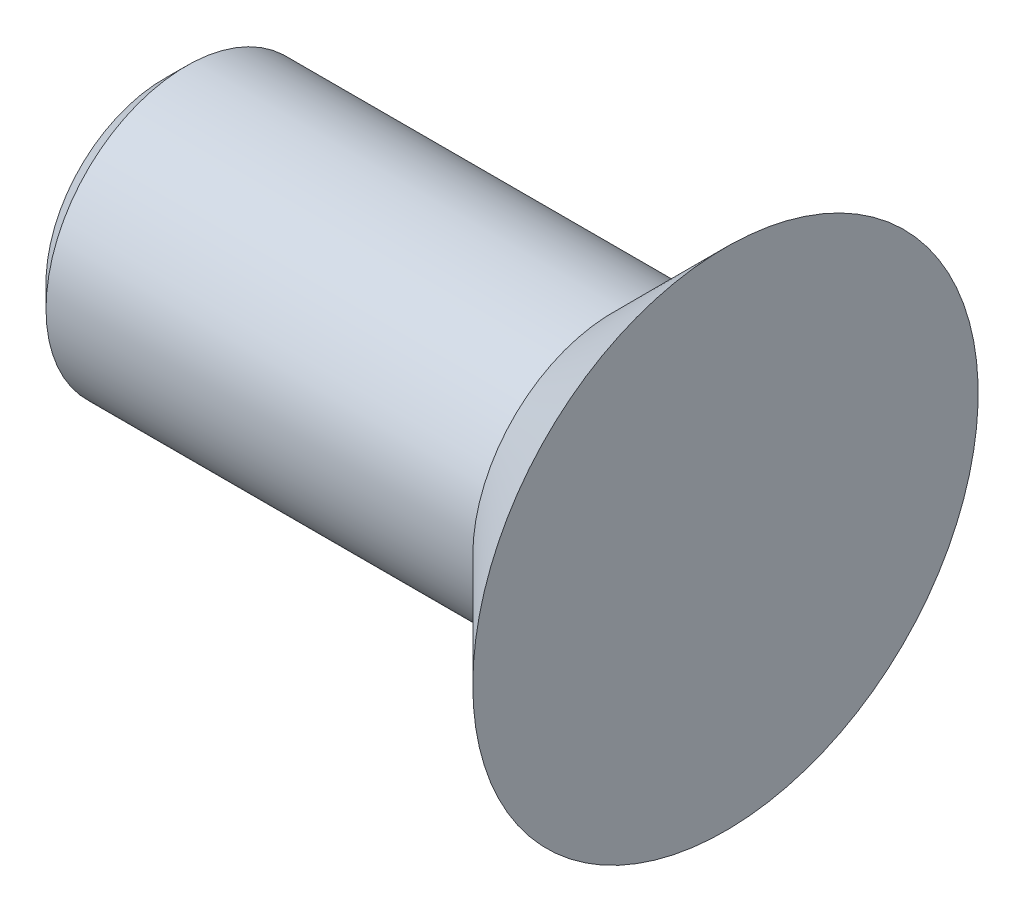
ISO-10303-21;
HEADER;
FILE_DESCRIPTION(('STEP AP214'),'2;1');
FILE_NAME('part.step','',(''),(''),'','','');
FILE_SCHEMA(('AUTOMOTIVE_DESIGN { 1 0 10303 214 1 1 1 1 }'));
ENDSEC;
DATA;
#1=APPLICATION_CONTEXT('core data for automotive mechanical design processes');
#2=APPLICATION_PROTOCOL_DEFINITION('international standard','automotive_design',2000,#1);
#3=PRODUCT_CONTEXT('',#1,'mechanical');
#4=PRODUCT('Part','Part','',(#3));
#5=PRODUCT_RELATED_PRODUCT_CATEGORY('part','',(#4));
#6=PRODUCT_DEFINITION_FORMATION('','',#4);
#7=PRODUCT_DEFINITION_CONTEXT('part definition',#1,'design');
#8=PRODUCT_DEFINITION('design','',#6,#7);
#9=PRODUCT_DEFINITION_SHAPE('','',#8);
#10=(LENGTH_UNIT() NAMED_UNIT(*) SI_UNIT(.MILLI.,.METRE.));
#11=(NAMED_UNIT(*) PLANE_ANGLE_UNIT() SI_UNIT($,.RADIAN.));
#12=(NAMED_UNIT(*) SI_UNIT($,.STERADIAN.) SOLID_ANGLE_UNIT());
#13=UNCERTAINTY_MEASURE_WITH_UNIT(LENGTH_MEASURE(1.E-05),#10,'distance_accuracy_value','');
#14=(GEOMETRIC_REPRESENTATION_CONTEXT(3) GLOBAL_UNCERTAINTY_ASSIGNED_CONTEXT((#13)) GLOBAL_UNIT_ASSIGNED_CONTEXT((#10,
#11,#12)) REPRESENTATION_CONTEXT('',''));
#15=CARTESIAN_POINT('',(0.,0.,0.));
#16=DIRECTION('',(0.,0.,1.));
#17=DIRECTION('',(1.,0.,0.));
#18=AXIS2_PLACEMENT_3D('',#15,#16,#17);
#19=CARTESIAN_POINT('',(0.,4.49999999999998,0.));
#20=DIRECTION('',(-1.,0.,0.));
#21=DIRECTION('',(0.,0.,1.));
#22=AXIS2_PLACEMENT_3D('',#19,#20,#21);
#23=PLANE('',#22);
#24=CARTESIAN_POINT('',(0.,0.,0.));
#25=DIRECTION('',(-1.,0.,0.));
#26=DIRECTION('',(0.,0.,1.));
#27=AXIS2_PLACEMENT_3D('',#24,#25,#26);
#28=CIRCLE('',#27,4.49999999999998);
#29=CARTESIAN_POINT('',(0.,0.,4.49999999999998));
#30=VERTEX_POINT('',#29);
#31=EDGE_CURVE('E35',#30,#30,#28,.T.);
#32=ORIENTED_EDGE('',*,*,#31,.F.);
#33=EDGE_LOOP('',(#32));
#34=FACE_BOUND('',#33,.T.);
#35=ADVANCED_FACE('F25',(#34),#23,.F.);
#36=CARTESIAN_POINT('',(0.,0.,0.));
#37=DIRECTION('',(1.,0.,0.));
#38=DIRECTION('',(0.,0.,-1.));
#39=AXIS2_PLACEMENT_3D('',#36,#37,#38);
#40=CONICAL_SURFACE('',#39,4.49999999999998,0.785398163397443);
#41=CARTESIAN_POINT('',(-2.,0.,0.));
#42=DIRECTION('',(-1.,0.,0.));
#43=DIRECTION('',(0.,0.,1.));
#44=AXIS2_PLACEMENT_3D('',#41,#42,#43);
#45=CIRCLE('',#44,2.5);
#46=CARTESIAN_POINT('',(-2.,0.,2.5));
#47=VERTEX_POINT('',#46);
#48=EDGE_CURVE('E39',#47,#47,#45,.T.);
#49=ORIENTED_EDGE('',*,*,#48,.F.);
#50=EDGE_LOOP('',(#49));
#51=FACE_BOUND('',#50,.T.);
#52=ORIENTED_EDGE('',*,*,#31,.T.);
#53=EDGE_LOOP('',(#52));
#54=FACE_BOUND('',#53,.T.);
#55=ADVANCED_FACE('F47',(#51,#54),#40,.T.);
#56=CARTESIAN_POINT('',(0.,0.,0.));
#57=DIRECTION('',(-1.,0.,0.));
#58=DIRECTION('',(0.,0.,1.));
#59=AXIS2_PLACEMENT_3D('',#56,#57,#58);
#60=CYLINDRICAL_SURFACE('',#59,2.5);
#61=CARTESIAN_POINT('',(-9.6,0.,0.));
#62=DIRECTION('',(1.,0.,0.));
#63=DIRECTION('',(0.,0.,-1.));
#64=AXIS2_PLACEMENT_3D('',#61,#62,#63);
#65=CIRCLE('',#64,2.5);
#66=CARTESIAN_POINT('',(-9.6,0.,-2.5));
#67=VERTEX_POINT('',#66);
#68=EDGE_CURVE('E10',#67,#67,#65,.T.);
#69=ORIENTED_EDGE('',*,*,#68,.T.);
#70=EDGE_LOOP('',(#69));
#71=FACE_BOUND('',#70,.T.);
#72=ORIENTED_EDGE('',*,*,#48,.T.);
#73=EDGE_LOOP('',(#72));
#74=FACE_BOUND('',#73,.T.);
#75=ADVANCED_FACE('F45',(#71,#74),#60,.T.);
#76=CARTESIAN_POINT('',(-10.,0.,0.));
#77=DIRECTION('',(1.,0.,0.));
#78=DIRECTION('',(0.,0.,-1.));
#79=AXIS2_PLACEMENT_3D('',#76,#77,#78);
#80=PLANE('',#79);
#81=CARTESIAN_POINT('',(-10.,0.,0.));
#82=DIRECTION('',(1.,0.,0.));
#83=DIRECTION('',(0.,0.,-1.));
#84=AXIS2_PLACEMENT_3D('',#81,#82,#83);
#85=CIRCLE('',#84,2.1);
#86=CARTESIAN_POINT('',(-10.,0.,-2.1));
#87=VERTEX_POINT('',#86);
#88=EDGE_CURVE('E31',#87,#87,#85,.F.);
#89=ORIENTED_EDGE('',*,*,#88,.T.);
#90=EDGE_LOOP('',(#89));
#91=FACE_BOUND('',#90,.T.);
#92=ADVANCED_FACE('F65',(#91),#80,.F.);
#93=CARTESIAN_POINT('',(-10.,0.,0.));
#94=DIRECTION('',(1.,0.,0.));
#95=DIRECTION('',(0.,0.,-1.));
#96=AXIS2_PLACEMENT_3D('',#93,#94,#95);
#97=CONICAL_SURFACE('',#96,2.1,0.785398163397446);
#98=ORIENTED_EDGE('',*,*,#68,.F.);
#99=EDGE_LOOP('',(#98));
#100=FACE_BOUND('',#99,.T.);
#101=ORIENTED_EDGE('',*,*,#88,.F.);
#102=EDGE_LOOP('',(#101));
#103=FACE_BOUND('',#102,.T.);
#104=ADVANCED_FACE('F72',(#100,#103),#97,.T.);
#105=CLOSED_SHELL('',(#35,#55,#75,#92,#104));
#106=MANIFOLD_SOLID_BREP('B2',#105);
#107=ADVANCED_BREP_SHAPE_REPRESENTATION('',(#18,#106),#14);
#108=SHAPE_DEFINITION_REPRESENTATION(#9,#107);
ENDSEC;
END-ISO-10303-21;
